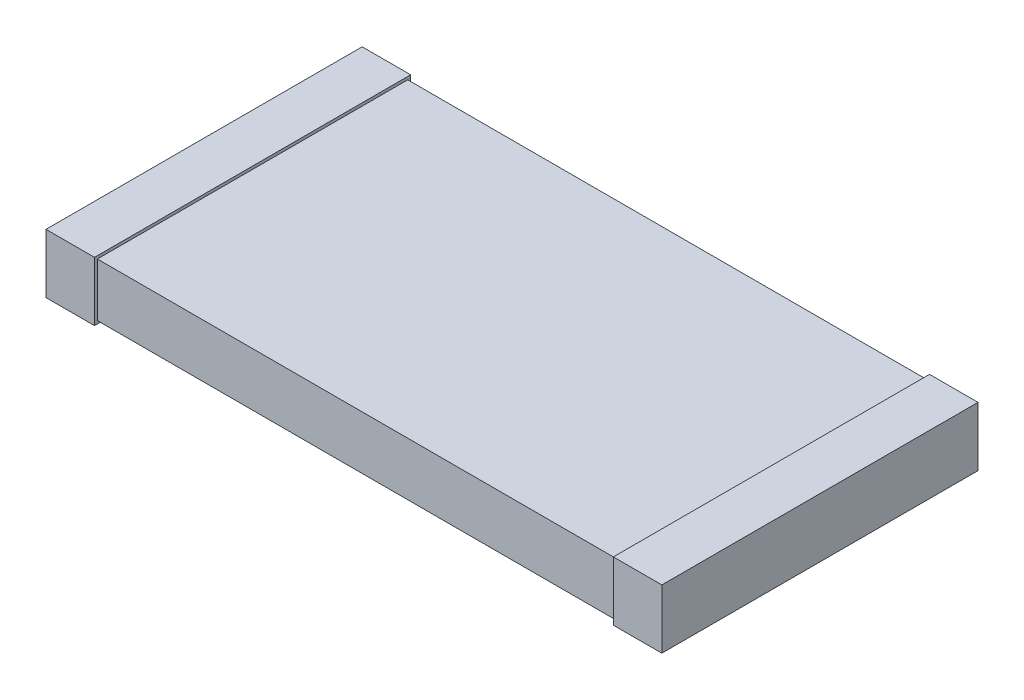
ISO-10303-21;
HEADER;
FILE_DESCRIPTION(('STEP AP214'),'2;1');
FILE_NAME('part.step','',(''),(''),'','','');
FILE_SCHEMA(('AUTOMOTIVE_DESIGN { 1 0 10303 214 1 1 1 1 }'));
ENDSEC;
DATA;
#1=APPLICATION_CONTEXT('core data for automotive mechanical design processes');
#2=APPLICATION_PROTOCOL_DEFINITION('international standard','automotive_design',2000,#1);
#3=PRODUCT_CONTEXT('',#1,'mechanical');
#4=PRODUCT('Part','Part','',(#3));
#5=PRODUCT_RELATED_PRODUCT_CATEGORY('part','',(#4));
#6=PRODUCT_DEFINITION_FORMATION('','',#4);
#7=PRODUCT_DEFINITION_CONTEXT('part definition',#1,'design');
#8=PRODUCT_DEFINITION('design','',#6,#7);
#9=PRODUCT_DEFINITION_SHAPE('','',#8);
#10=(LENGTH_UNIT() NAMED_UNIT(*) SI_UNIT(.MILLI.,.METRE.));
#11=(NAMED_UNIT(*) PLANE_ANGLE_UNIT() SI_UNIT($,.RADIAN.));
#12=(NAMED_UNIT(*) SI_UNIT($,.STERADIAN.) SOLID_ANGLE_UNIT());
#13=UNCERTAINTY_MEASURE_WITH_UNIT(LENGTH_MEASURE(1.E-05),#10,'distance_accuracy_value','');
#14=(GEOMETRIC_REPRESENTATION_CONTEXT(3) GLOBAL_UNCERTAINTY_ASSIGNED_CONTEXT((#13)) GLOBAL_UNIT_ASSIGNED_CONTEXT((#10,
#11,#12)) REPRESENTATION_CONTEXT('',''));
#15=CARTESIAN_POINT('',(0.,0.,0.));
#16=DIRECTION('',(0.,0.,1.));
#17=DIRECTION('',(1.,0.,0.));
#18=AXIS2_PLACEMENT_3D('',#15,#16,#17);
#19=CARTESIAN_POINT('',(-3.175,0.55,1.6));
#20=DIRECTION('',(0.,0.,-1.));
#21=DIRECTION('',(-1.,0.,0.));
#22=AXIS2_PLACEMENT_3D('',#19,#20,#21);
#23=PLANE('',#22);
#24=DIRECTION('',(0.,-1.,0.));
#25=VECTOR('',#24,1.);
#26=CARTESIAN_POINT('',(2.675,0.55,1.6));
#27=LINE('',#26,#25);
#28=CARTESIAN_POINT('',(2.675,0.55,1.6));
#29=VERTEX_POINT('',#28);
#30=CARTESIAN_POINT('',(2.675,0.,1.6));
#31=VERTEX_POINT('',#30);
#32=EDGE_CURVE('E51',#29,#31,#27,.T.);
#33=ORIENTED_EDGE('',*,*,#32,.F.);
#34=DIRECTION('',(1.,0.,0.));
#35=VECTOR('',#34,1.);
#36=CARTESIAN_POINT('',(-3.175,0.55,1.6));
#37=LINE('',#36,#35);
#38=CARTESIAN_POINT('',(-2.675,0.55,1.6));
#39=VERTEX_POINT('',#38);
#40=EDGE_CURVE('E216',#39,#29,#37,.T.);
#41=ORIENTED_EDGE('',*,*,#40,.F.);
#42=DIRECTION('',(0.,1.,0.));
#43=VECTOR('',#42,1.);
#44=CARTESIAN_POINT('',(-2.675,0.55,1.6));
#45=LINE('',#44,#43);
#46=CARTESIAN_POINT('',(-2.675,0.,1.6));
#47=VERTEX_POINT('',#46);
#48=EDGE_CURVE('E210',#47,#39,#45,.T.);
#49=ORIENTED_EDGE('',*,*,#48,.F.);
#50=DIRECTION('',(1.,0.,0.));
#51=VECTOR('',#50,1.);
#52=CARTESIAN_POINT('',(-3.175,0.,1.6));
#53=LINE('',#52,#51);
#54=EDGE_CURVE('E215',#47,#31,#53,.T.);
#55=ORIENTED_EDGE('',*,*,#54,.T.);
#56=EDGE_LOOP('',(#33,#41,#49,#55));
#57=FACE_BOUND('',#56,.T.);
#58=ADVANCED_FACE('F36',(#57),#23,.F.);
#59=CARTESIAN_POINT('',(-3.175,0.55,-1.6));
#60=DIRECTION('',(0.,0.,1.));
#61=DIRECTION('',(1.,0.,0.));
#62=AXIS2_PLACEMENT_3D('',#59,#60,#61);
#63=PLANE('',#62);
#64=DIRECTION('',(0.,1.,0.));
#65=VECTOR('',#64,1.);
#66=CARTESIAN_POINT('',(2.675,0.55,-1.6));
#67=LINE('',#66,#65);
#68=CARTESIAN_POINT('',(2.675,0.,-1.6));
#69=VERTEX_POINT('',#68);
#70=CARTESIAN_POINT('',(2.675,0.55,-1.6));
#71=VERTEX_POINT('',#70);
#72=EDGE_CURVE('E165',#69,#71,#67,.T.);
#73=ORIENTED_EDGE('',*,*,#72,.F.);
#74=DIRECTION('',(-1.,0.,0.));
#75=VECTOR('',#74,1.);
#76=CARTESIAN_POINT('',(-3.175,0.,-1.6));
#77=LINE('',#76,#75);
#78=CARTESIAN_POINT('',(-2.675,0.,-1.6));
#79=VERTEX_POINT('',#78);
#80=EDGE_CURVE('E219',#69,#79,#77,.T.);
#81=ORIENTED_EDGE('',*,*,#80,.T.);
#82=DIRECTION('',(0.,-1.,0.));
#83=VECTOR('',#82,1.);
#84=CARTESIAN_POINT('',(-2.675,0.55,-1.6));
#85=LINE('',#84,#83);
#86=CARTESIAN_POINT('',(-2.675,0.55,-1.6));
#87=VERTEX_POINT('',#86);
#88=EDGE_CURVE('E198',#87,#79,#85,.T.);
#89=ORIENTED_EDGE('',*,*,#88,.F.);
#90=DIRECTION('',(-1.,0.,0.));
#91=VECTOR('',#90,1.);
#92=CARTESIAN_POINT('',(-3.175,0.55,-1.6));
#93=LINE('',#92,#91);
#94=EDGE_CURVE('E218',#71,#87,#93,.T.);
#95=ORIENTED_EDGE('',*,*,#94,.F.);
#96=EDGE_LOOP('',(#73,#81,#89,#95));
#97=FACE_BOUND('',#96,.T.);
#98=ADVANCED_FACE('F236',(#97),#63,.F.);
#99=CARTESIAN_POINT('',(-3.175,0.55,1.6));
#100=DIRECTION('',(0.,1.,0.));
#101=DIRECTION('',(0.,0.,1.));
#102=AXIS2_PLACEMENT_3D('',#99,#100,#101);
#103=PLANE('',#102);
#104=ORIENTED_EDGE('',*,*,#40,.T.);
#105=DIRECTION('',(0.,0.,-1.));
#106=VECTOR('',#105,1.);
#107=CARTESIAN_POINT('',(2.675,0.55,1.6));
#108=LINE('',#107,#106);
#109=EDGE_CURVE('E58',#29,#71,#108,.T.);
#110=ORIENTED_EDGE('',*,*,#109,.T.);
#111=ORIENTED_EDGE('',*,*,#94,.T.);
#112=DIRECTION('',(0.,0.,1.));
#113=VECTOR('',#112,1.);
#114=CARTESIAN_POINT('',(-2.675,0.55,1.6));
#115=LINE('',#114,#113);
#116=EDGE_CURVE('E213',#87,#39,#115,.T.);
#117=ORIENTED_EDGE('',*,*,#116,.T.);
#118=EDGE_LOOP('',(#104,#110,#111,#117));
#119=FACE_BOUND('',#118,.T.);
#120=ADVANCED_FACE('F233',(#119),#103,.T.);
#121=CARTESIAN_POINT('',(-3.175,0.,1.6));
#122=DIRECTION('',(0.,1.,0.));
#123=DIRECTION('',(0.,0.,1.));
#124=AXIS2_PLACEMENT_3D('',#121,#122,#123);
#125=PLANE('',#124);
#126=DIRECTION('',(0.,0.,-1.));
#127=VECTOR('',#126,1.);
#128=CARTESIAN_POINT('',(2.675,0.,1.6));
#129=LINE('',#128,#127);
#130=EDGE_CURVE('E12',#31,#69,#129,.T.);
#131=ORIENTED_EDGE('',*,*,#130,.F.);
#132=ORIENTED_EDGE('',*,*,#54,.F.);
#133=DIRECTION('',(0.,0.,1.));
#134=VECTOR('',#133,1.);
#135=CARTESIAN_POINT('',(-2.675,0.,1.6));
#136=LINE('',#135,#134);
#137=EDGE_CURVE('E44',#79,#47,#136,.T.);
#138=ORIENTED_EDGE('',*,*,#137,.F.);
#139=ORIENTED_EDGE('',*,*,#80,.F.);
#140=EDGE_LOOP('',(#131,#132,#138,#139));
#141=FACE_BOUND('',#140,.T.);
#142=ADVANCED_FACE('F231',(#141),#125,.F.);
#143=CARTESIAN_POINT('',(-2.675,-0.0300000000000002,2.44873316146844));
#144=DIRECTION('',(0.,1.,0.));
#145=DIRECTION('',(-1.,0.,0.));
#146=AXIS2_PLACEMENT_3D('',#143,#144,#145);
#147=PLANE('',#146);
#148=DIRECTION('',(0.,0.,-1.));
#149=VECTOR('',#148,1.);
#150=CARTESIAN_POINT('',(-2.675,-0.0300000000000002,2.44873316146844));
#151=LINE('',#150,#149);
#152=CARTESIAN_POINT('',(-2.675,-0.0300000000000002,1.63));
#153=VERTEX_POINT('',#152);
#154=CARTESIAN_POINT('',(-2.675,-0.0300000000000002,-1.63));
#155=VERTEX_POINT('',#154);
#156=EDGE_CURVE('E187',#153,#155,#151,.T.);
#157=ORIENTED_EDGE('',*,*,#156,.F.);
#158=DIRECTION('',(-1.,0.,0.));
#159=VECTOR('',#158,1.);
#160=CARTESIAN_POINT('',(-2.675,-0.0300000000000002,1.63));
#161=LINE('',#160,#159);
#162=CARTESIAN_POINT('',(-3.175,-0.0300000000000002,1.63));
#163=VERTEX_POINT('',#162);
#164=EDGE_CURVE('E192',#153,#163,#161,.T.);
#165=ORIENTED_EDGE('',*,*,#164,.T.);
#166=DIRECTION('',(0.,0.,-1.));
#167=VECTOR('',#166,1.);
#168=CARTESIAN_POINT('',(-3.175,-0.0300000000000002,2.44873316146844));
#169=LINE('',#168,#167);
#170=CARTESIAN_POINT('',(-3.175,-0.0300000000000002,-1.63));
#171=VERTEX_POINT('',#170);
#172=EDGE_CURVE('E200',#163,#171,#169,.T.);
#173=ORIENTED_EDGE('',*,*,#172,.T.);
#174=DIRECTION('',(-1.,0.,0.));
#175=VECTOR('',#174,1.);
#176=CARTESIAN_POINT('',(-2.675,-0.0300000000000002,-1.63));
#177=LINE('',#176,#175);
#178=EDGE_CURVE('E178',#155,#171,#177,.T.);
#179=ORIENTED_EDGE('',*,*,#178,.F.);
#180=EDGE_LOOP('',(#157,#165,#173,#179));
#181=FACE_BOUND('',#180,.T.);
#182=ADVANCED_FACE('F277',(#181),#147,.F.);
#183=CARTESIAN_POINT('',(-2.675,0.58,2.44873316146844));
#184=DIRECTION('',(0.,-1.,0.));
#185=DIRECTION('',(1.,0.,0.));
#186=AXIS2_PLACEMENT_3D('',#183,#184,#185);
#187=PLANE('',#186);
#188=DIRECTION('',(0.,0.,-1.));
#189=VECTOR('',#188,1.);
#190=CARTESIAN_POINT('',(-3.175,0.58,2.44873316146844));
#191=LINE('',#190,#189);
#192=CARTESIAN_POINT('',(-3.175,0.58,1.63));
#193=VERTEX_POINT('',#192);
#194=CARTESIAN_POINT('',(-3.175,0.58,-1.63));
#195=VERTEX_POINT('',#194);
#196=EDGE_CURVE('E202',#193,#195,#191,.T.);
#197=ORIENTED_EDGE('',*,*,#196,.F.);
#198=DIRECTION('',(1.,0.,0.));
#199=VECTOR('',#198,1.);
#200=CARTESIAN_POINT('',(-2.675,0.58,1.63));
#201=LINE('',#200,#199);
#202=CARTESIAN_POINT('',(-2.675,0.58,1.63));
#203=VERTEX_POINT('',#202);
#204=EDGE_CURVE('E191',#193,#203,#201,.T.);
#205=ORIENTED_EDGE('',*,*,#204,.T.);
#206=DIRECTION('',(0.,0.,-1.));
#207=VECTOR('',#206,1.);
#208=CARTESIAN_POINT('',(-2.675,0.58,2.44873316146844));
#209=LINE('',#208,#207);
#210=CARTESIAN_POINT('',(-2.675,0.58,-1.63));
#211=VERTEX_POINT('',#210);
#212=EDGE_CURVE('E204',#203,#211,#209,.T.);
#213=ORIENTED_EDGE('',*,*,#212,.T.);
#214=DIRECTION('',(1.,0.,0.));
#215=VECTOR('',#214,1.);
#216=CARTESIAN_POINT('',(-2.675,0.58,-1.63));
#217=LINE('',#216,#215);
#218=EDGE_CURVE('E184',#195,#211,#217,.T.);
#219=ORIENTED_EDGE('',*,*,#218,.F.);
#220=EDGE_LOOP('',(#197,#205,#213,#219));
#221=FACE_BOUND('',#220,.T.);
#222=ADVANCED_FACE('F280',(#221),#187,.F.);
#223=CARTESIAN_POINT('',(-2.675,0.58,2.44873316146844));
#224=DIRECTION('',(-1.,0.,0.));
#225=DIRECTION('',(0.,0.,1.));
#226=AXIS2_PLACEMENT_3D('',#223,#224,#225);
#227=PLANE('',#226);
#228=ORIENTED_EDGE('',*,*,#116,.F.);
#229=ORIENTED_EDGE('',*,*,#88,.T.);
#230=ORIENTED_EDGE('',*,*,#137,.T.);
#231=ORIENTED_EDGE('',*,*,#48,.T.);
#232=EDGE_LOOP('',(#228,#229,#230,#231));
#233=FACE_BOUND('',#232,.T.);
#234=ORIENTED_EDGE('',*,*,#212,.F.);
#235=DIRECTION('',(0.,-1.,0.));
#236=VECTOR('',#235,1.);
#237=CARTESIAN_POINT('',(-2.675,0.58,1.63));
#238=LINE('',#237,#236);
#239=EDGE_CURVE('E195',#203,#153,#238,.T.);
#240=ORIENTED_EDGE('',*,*,#239,.T.);
#241=ORIENTED_EDGE('',*,*,#156,.T.);
#242=DIRECTION('',(0.,-1.,0.));
#243=VECTOR('',#242,1.);
#244=CARTESIAN_POINT('',(-2.675,0.58,-1.63));
#245=LINE('',#244,#243);
#246=EDGE_CURVE('E181',#211,#155,#245,.T.);
#247=ORIENTED_EDGE('',*,*,#246,.F.);
#248=EDGE_LOOP('',(#234,#240,#241,#247));
#249=FACE_BOUND('',#248,.T.);
#250=ADVANCED_FACE('F226',(#233,#249),#227,.F.);
#251=CARTESIAN_POINT('',(-3.175,0.55,1.63));
#252=DIRECTION('',(0.,0.,-1.));
#253=DIRECTION('',(-1.,0.,0.));
#254=AXIS2_PLACEMENT_3D('',#251,#252,#253);
#255=PLANE('',#254);
#256=ORIENTED_EDGE('',*,*,#204,.F.);
#257=DIRECTION('',(0.,1.,0.));
#258=VECTOR('',#257,1.);
#259=CARTESIAN_POINT('',(-3.175,0.58,1.63));
#260=LINE('',#259,#258);
#261=EDGE_CURVE('E188',#163,#193,#260,.T.);
#262=ORIENTED_EDGE('',*,*,#261,.F.);
#263=ORIENTED_EDGE('',*,*,#164,.F.);
#264=ORIENTED_EDGE('',*,*,#239,.F.);
#265=EDGE_LOOP('',(#256,#262,#263,#264));
#266=FACE_BOUND('',#265,.T.);
#267=ADVANCED_FACE('F272',(#266),#255,.F.);
#268=CARTESIAN_POINT('',(-3.175,0.55,-1.63));
#269=DIRECTION('',(0.,0.,1.));
#270=DIRECTION('',(1.,0.,0.));
#271=AXIS2_PLACEMENT_3D('',#268,#269,#270);
#272=PLANE('',#271);
#273=ORIENTED_EDGE('',*,*,#246,.T.);
#274=ORIENTED_EDGE('',*,*,#178,.T.);
#275=DIRECTION('',(0.,1.,0.));
#276=VECTOR('',#275,1.);
#277=CARTESIAN_POINT('',(-3.175,0.58,-1.63));
#278=LINE('',#277,#276);
#279=EDGE_CURVE('E175',#171,#195,#278,.T.);
#280=ORIENTED_EDGE('',*,*,#279,.T.);
#281=ORIENTED_EDGE('',*,*,#218,.T.);
#282=EDGE_LOOP('',(#273,#274,#280,#281));
#283=FACE_BOUND('',#282,.T.);
#284=ADVANCED_FACE('F269',(#283),#272,.F.);
#285=CARTESIAN_POINT('',(-3.175,0.55,-1.6));
#286=DIRECTION('',(1.,0.,0.));
#287=DIRECTION('',(0.,0.,-1.));
#288=AXIS2_PLACEMENT_3D('',#285,#286,#287);
#289=PLANE('',#288);
#290=ORIENTED_EDGE('',*,*,#172,.F.);
#291=ORIENTED_EDGE('',*,*,#261,.T.);
#292=ORIENTED_EDGE('',*,*,#196,.T.);
#293=ORIENTED_EDGE('',*,*,#279,.F.);
#294=EDGE_LOOP('',(#290,#291,#292,#293));
#295=FACE_BOUND('',#294,.T.);
#296=ADVANCED_FACE('F38',(#295),#289,.F.);
#297=CARTESIAN_POINT('',(2.675,-0.0299999999999995,2.44873316146844));
#298=DIRECTION('',(0.,1.,0.));
#299=DIRECTION('',(-1.,0.,0.));
#300=AXIS2_PLACEMENT_3D('',#297,#298,#299);
#301=PLANE('',#300);
#302=DIRECTION('',(0.,0.,-1.));
#303=VECTOR('',#302,1.);
#304=CARTESIAN_POINT('',(3.175,-0.0299999999999994,2.44873316146844));
#305=LINE('',#304,#303);
#306=CARTESIAN_POINT('',(3.175,-0.0299999999999994,1.63));
#307=VERTEX_POINT('',#306);
#308=CARTESIAN_POINT('',(3.175,-0.0299999999999994,-1.63));
#309=VERTEX_POINT('',#308);
#310=EDGE_CURVE('E138',#307,#309,#305,.T.);
#311=ORIENTED_EDGE('',*,*,#310,.F.);
#312=DIRECTION('',(-1.,0.,0.));
#313=VECTOR('',#312,1.);
#314=CARTESIAN_POINT('',(2.675,-0.0299999999999995,1.63));
#315=LINE('',#314,#313);
#316=CARTESIAN_POINT('',(2.675,-0.0299999999999995,1.63));
#317=VERTEX_POINT('',#316);
#318=EDGE_CURVE('E133',#307,#317,#315,.T.);
#319=ORIENTED_EDGE('',*,*,#318,.T.);
#320=DIRECTION('',(0.,0.,-1.));
#321=VECTOR('',#320,1.);
#322=CARTESIAN_POINT('',(2.675,-0.0299999999999995,2.44873316146844));
#323=LINE('',#322,#321);
#324=CARTESIAN_POINT('',(2.675,-0.0299999999999995,-1.63));
#325=VERTEX_POINT('',#324);
#326=EDGE_CURVE('E128',#317,#325,#323,.T.);
#327=ORIENTED_EDGE('',*,*,#326,.T.);
#328=DIRECTION('',(-1.,0.,0.));
#329=VECTOR('',#328,1.);
#330=CARTESIAN_POINT('',(2.675,-0.0299999999999995,-1.63));
#331=LINE('',#330,#329);
#332=EDGE_CURVE('E132',#309,#325,#331,.T.);
#333=ORIENTED_EDGE('',*,*,#332,.F.);
#334=EDGE_LOOP('',(#311,#319,#327,#333));
#335=FACE_BOUND('',#334,.T.);
#336=ADVANCED_FACE('F131',(#335),#301,.F.);
#337=CARTESIAN_POINT('',(2.675,0.580000000000001,2.44873316146844));
#338=DIRECTION('',(1.,0.,0.));
#339=DIRECTION('',(0.,0.,-1.));
#340=AXIS2_PLACEMENT_3D('',#337,#338,#339);
#341=PLANE('',#340);
#342=ORIENTED_EDGE('',*,*,#109,.F.);
#343=ORIENTED_EDGE('',*,*,#32,.T.);
#344=ORIENTED_EDGE('',*,*,#130,.T.);
#345=ORIENTED_EDGE('',*,*,#72,.T.);
#346=EDGE_LOOP('',(#342,#343,#344,#345));
#347=FACE_BOUND('',#346,.T.);
#348=ORIENTED_EDGE('',*,*,#326,.F.);
#349=DIRECTION('',(0.,1.,0.));
#350=VECTOR('',#349,1.);
#351=CARTESIAN_POINT('',(2.675,0.580000000000001,1.63));
#352=LINE('',#351,#350);
#353=CARTESIAN_POINT('',(2.675,0.580000000000001,1.63));
#354=VERTEX_POINT('',#353);
#355=EDGE_CURVE('E160',#317,#354,#352,.T.);
#356=ORIENTED_EDGE('',*,*,#355,.T.);
#357=DIRECTION('',(0.,0.,-1.));
#358=VECTOR('',#357,1.);
#359=CARTESIAN_POINT('',(2.675,0.580000000000001,2.44873316146844));
#360=LINE('',#359,#358);
#361=CARTESIAN_POINT('',(2.675,0.580000000000001,-1.63));
#362=VERTEX_POINT('',#361);
#363=EDGE_CURVE('E137',#354,#362,#360,.T.);
#364=ORIENTED_EDGE('',*,*,#363,.T.);
#365=DIRECTION('',(0.,1.,0.));
#366=VECTOR('',#365,1.);
#367=CARTESIAN_POINT('',(2.675,0.580000000000001,-1.63));
#368=LINE('',#367,#366);
#369=EDGE_CURVE('E145',#325,#362,#368,.T.);
#370=ORIENTED_EDGE('',*,*,#369,.F.);
#371=EDGE_LOOP('',(#348,#356,#364,#370));
#372=FACE_BOUND('',#371,.T.);
#373=ADVANCED_FACE('F150',(#347,#372),#341,.F.);
#374=CARTESIAN_POINT('',(2.675,0.580000000000001,2.44873316146844));
#375=DIRECTION('',(0.,-1.,0.));
#376=DIRECTION('',(0.,0.,-1.));
#377=AXIS2_PLACEMENT_3D('',#374,#375,#376);
#378=PLANE('',#377);
#379=ORIENTED_EDGE('',*,*,#363,.F.);
#380=DIRECTION('',(1.,0.,0.));
#381=VECTOR('',#380,1.);
#382=CARTESIAN_POINT('',(2.675,0.580000000000001,1.63));
#383=LINE('',#382,#381);
#384=CARTESIAN_POINT('',(3.175,0.580000000000001,1.63));
#385=VERTEX_POINT('',#384);
#386=EDGE_CURVE('E163',#354,#385,#383,.T.);
#387=ORIENTED_EDGE('',*,*,#386,.T.);
#388=DIRECTION('',(0.,0.,-1.));
#389=VECTOR('',#388,1.);
#390=CARTESIAN_POINT('',(3.175,0.580000000000001,2.44873316146844));
#391=LINE('',#390,#389);
#392=CARTESIAN_POINT('',(3.175,0.580000000000001,-1.63));
#393=VERTEX_POINT('',#392);
#394=EDGE_CURVE('E152',#385,#393,#391,.T.);
#395=ORIENTED_EDGE('',*,*,#394,.T.);
#396=DIRECTION('',(1.,0.,0.));
#397=VECTOR('',#396,1.);
#398=CARTESIAN_POINT('',(2.675,0.580000000000001,-1.63));
#399=LINE('',#398,#397);
#400=EDGE_CURVE('E153',#362,#393,#399,.T.);
#401=ORIENTED_EDGE('',*,*,#400,.F.);
#402=EDGE_LOOP('',(#379,#387,#395,#401));
#403=FACE_BOUND('',#402,.T.);
#404=ADVANCED_FACE('F256',(#403),#378,.F.);
#405=CARTESIAN_POINT('',(-3.175,0.55,1.63));
#406=DIRECTION('',(0.,0.,-1.));
#407=DIRECTION('',(-1.,0.,0.));
#408=AXIS2_PLACEMENT_3D('',#405,#406,#407);
#409=PLANE('',#408);
#410=ORIENTED_EDGE('',*,*,#355,.F.);
#411=ORIENTED_EDGE('',*,*,#318,.F.);
#412=DIRECTION('',(0.,-1.,0.));
#413=VECTOR('',#412,1.);
#414=CARTESIAN_POINT('',(3.175,0.580000000000001,1.63));
#415=LINE('',#414,#413);
#416=EDGE_CURVE('E161',#385,#307,#415,.T.);
#417=ORIENTED_EDGE('',*,*,#416,.F.);
#418=ORIENTED_EDGE('',*,*,#386,.F.);
#419=EDGE_LOOP('',(#410,#411,#417,#418));
#420=FACE_BOUND('',#419,.T.);
#421=ADVANCED_FACE('F252',(#420),#409,.F.);
#422=CARTESIAN_POINT('',(-3.175,0.55,-1.63));
#423=DIRECTION('',(0.,0.,1.));
#424=DIRECTION('',(1.,0.,0.));
#425=AXIS2_PLACEMENT_3D('',#422,#423,#424);
#426=PLANE('',#425);
#427=ORIENTED_EDGE('',*,*,#400,.T.);
#428=DIRECTION('',(0.,-1.,0.));
#429=VECTOR('',#428,1.);
#430=CARTESIAN_POINT('',(3.175,0.580000000000001,-1.63));
#431=LINE('',#430,#429);
#432=EDGE_CURVE('E148',#393,#309,#431,.T.);
#433=ORIENTED_EDGE('',*,*,#432,.T.);
#434=ORIENTED_EDGE('',*,*,#332,.T.);
#435=ORIENTED_EDGE('',*,*,#369,.T.);
#436=EDGE_LOOP('',(#427,#433,#434,#435));
#437=FACE_BOUND('',#436,.T.);
#438=ADVANCED_FACE('F144',(#437),#426,.F.);
#439=CARTESIAN_POINT('',(3.175,0.55,-1.6));
#440=DIRECTION('',(-1.,0.,0.));
#441=DIRECTION('',(0.,0.,1.));
#442=AXIS2_PLACEMENT_3D('',#439,#440,#441);
#443=PLANE('',#442);
#444=ORIENTED_EDGE('',*,*,#394,.F.);
#445=ORIENTED_EDGE('',*,*,#416,.T.);
#446=ORIENTED_EDGE('',*,*,#310,.T.);
#447=ORIENTED_EDGE('',*,*,#432,.F.);
#448=EDGE_LOOP('',(#444,#445,#446,#447));
#449=FACE_BOUND('',#448,.T.);
#450=ADVANCED_FACE('F246',(#449),#443,.F.);
#451=CLOSED_SHELL('',(#58,#98,#120,#142,#182,#222,#250,#267,#284,#296,#336,#373,#404,#421,#438,#450));
#452=MANIFOLD_SOLID_BREP('B2',#451);
#453=ADVANCED_BREP_SHAPE_REPRESENTATION('',(#18,#452),#14);
#454=SHAPE_DEFINITION_REPRESENTATION(#9,#453);
ENDSEC;
END-ISO-10303-21;
